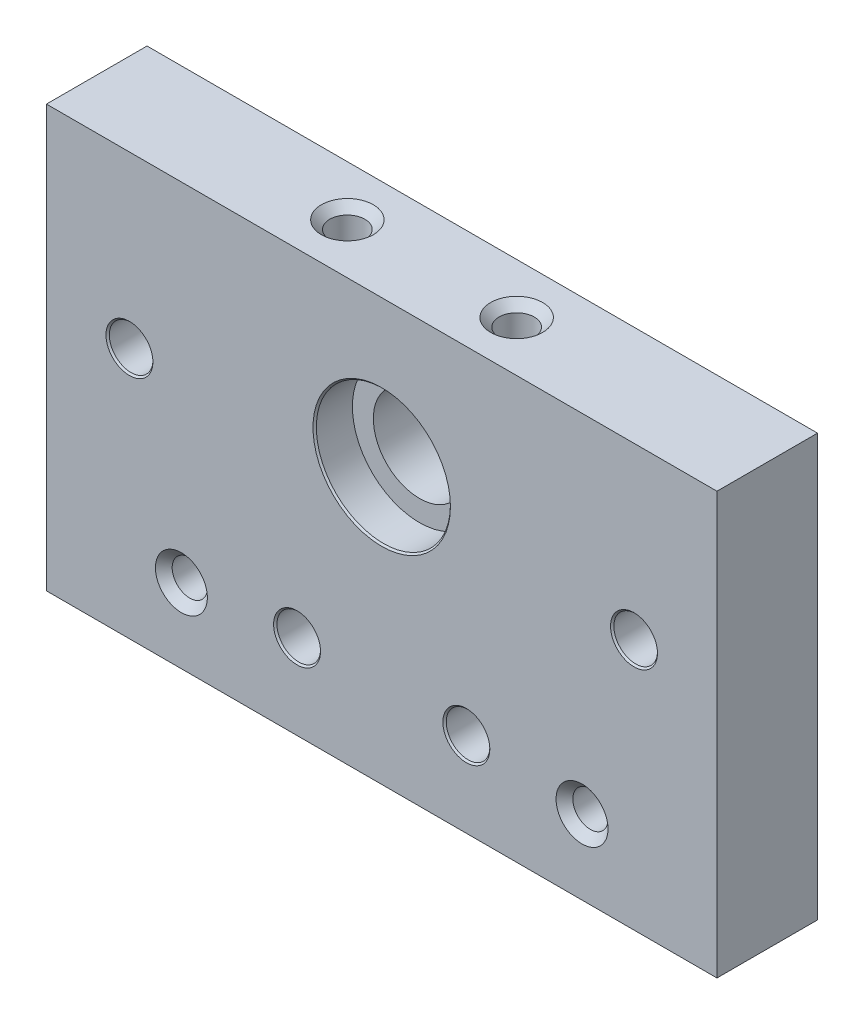
ISO-10303-21;
HEADER;
FILE_DESCRIPTION(('STEP AP214'),'2;1');
FILE_NAME('part.step','',(''),(''),'','','');
FILE_SCHEMA(('AUTOMOTIVE_DESIGN { 1 0 10303 214 1 1 1 1 }'));
ENDSEC;
DATA;
#1=APPLICATION_CONTEXT('core data for automotive mechanical design processes');
#2=APPLICATION_PROTOCOL_DEFINITION('international standard','automotive_design',2000,#1);
#3=PRODUCT_CONTEXT('',#1,'mechanical');
#4=PRODUCT('Part','Part','',(#3));
#5=PRODUCT_RELATED_PRODUCT_CATEGORY('part','',(#4));
#6=PRODUCT_DEFINITION_FORMATION('','',#4);
#7=PRODUCT_DEFINITION_CONTEXT('part definition',#1,'design');
#8=PRODUCT_DEFINITION('design','',#6,#7);
#9=PRODUCT_DEFINITION_SHAPE('','',#8);
#10=(LENGTH_UNIT() NAMED_UNIT(*) SI_UNIT(.MILLI.,.METRE.));
#11=(NAMED_UNIT(*) PLANE_ANGLE_UNIT() SI_UNIT($,.RADIAN.));
#12=(NAMED_UNIT(*) SI_UNIT($,.STERADIAN.) SOLID_ANGLE_UNIT());
#13=UNCERTAINTY_MEASURE_WITH_UNIT(LENGTH_MEASURE(1.E-05),#10,'distance_accuracy_value','');
#14=(GEOMETRIC_REPRESENTATION_CONTEXT(3) GLOBAL_UNCERTAINTY_ASSIGNED_CONTEXT((#13)) GLOBAL_UNIT_ASSIGNED_CONTEXT((#10,
#11,#12)) REPRESENTATION_CONTEXT('',''));
#15=CARTESIAN_POINT('',(0.,0.,0.));
#16=DIRECTION('',(0.,0.,1.));
#17=DIRECTION('',(1.,0.,0.));
#18=AXIS2_PLACEMENT_3D('',#15,#16,#17);
#19=CARTESIAN_POINT('',(28.4884071156695,7.83961797233232,4.62246076924066));
#20=DIRECTION('',(0.,0.,-1.));
#21=DIRECTION('',(-1.,0.,0.));
#22=AXIS2_PLACEMENT_3D('',#19,#20,#21);
#23=CYLINDRICAL_SURFACE('',#22,2.6);
#24=CARTESIAN_POINT('',(28.4884071156695,7.83961797233232,4.42246076924066));
#25=DIRECTION('',(0.,0.,1.));
#26=DIRECTION('',(1.,0.,0.));
#27=AXIS2_PLACEMENT_3D('',#24,#25,#26);
#28=CIRCLE('',#27,2.6);
#29=CARTESIAN_POINT('',(31.0884071156695,7.83961797233232,4.42246076924066));
#30=VERTEX_POINT('',#29);
#31=EDGE_CURVE('E141',#30,#30,#28,.T.);
#32=ORIENTED_EDGE('',*,*,#31,.T.);
#33=EDGE_LOOP('',(#32));
#34=FACE_BOUND('',#33,.T.);
#35=CARTESIAN_POINT('',(28.4884071156695,7.83961797233232,-5.37753923075934));
#36=DIRECTION('',(0.,0.,-1.));
#37=DIRECTION('',(-1.,0.,0.));
#38=AXIS2_PLACEMENT_3D('',#35,#36,#37);
#39=CIRCLE('',#38,2.6);
#40=CARTESIAN_POINT('',(25.8884071156695,7.83961797233232,-5.37753923075934));
#41=VERTEX_POINT('',#40);
#42=EDGE_CURVE('E108',#41,#41,#39,.T.);
#43=ORIENTED_EDGE('',*,*,#42,.T.);
#44=EDGE_LOOP('',(#43));
#45=FACE_BOUND('',#44,.T.);
#46=ADVANCED_FACE('F16',(#34,#45),#23,.F.);
#47=CARTESIAN_POINT('',(8.48840711566945,-12.0603820276677,4.62246076924066));
#48=DIRECTION('',(0.,0.,-1.));
#49=DIRECTION('',(-1.,0.,0.));
#50=AXIS2_PLACEMENT_3D('',#47,#48,#49);
#51=CYLINDRICAL_SURFACE('',#50,2.6);
#52=CARTESIAN_POINT('',(8.48840711566945,-12.0603820276677,4.42246076924066));
#53=DIRECTION('',(0.,0.,1.));
#54=DIRECTION('',(1.,0.,0.));
#55=AXIS2_PLACEMENT_3D('',#52,#53,#54);
#56=CIRCLE('',#55,2.6);
#57=CARTESIAN_POINT('',(11.0884071156695,-12.0603820276677,4.42246076924066));
#58=VERTEX_POINT('',#57);
#59=EDGE_CURVE('E159',#58,#58,#56,.T.);
#60=ORIENTED_EDGE('',*,*,#59,.T.);
#61=EDGE_LOOP('',(#60));
#62=FACE_BOUND('',#61,.T.);
#63=CARTESIAN_POINT('',(8.48840711566945,-12.0603820276677,-5.37753923075934));
#64=DIRECTION('',(0.,0.,-1.));
#65=DIRECTION('',(-1.,0.,0.));
#66=AXIS2_PLACEMENT_3D('',#63,#64,#65);
#67=CIRCLE('',#66,2.6);
#68=CARTESIAN_POINT('',(5.88840711566945,-12.0603820276677,-5.37753923075934));
#69=VERTEX_POINT('',#68);
#70=EDGE_CURVE('E105',#69,#69,#67,.T.);
#71=ORIENTED_EDGE('',*,*,#70,.T.);
#72=EDGE_LOOP('',(#71));
#73=FACE_BOUND('',#72,.T.);
#74=ADVANCED_FACE('F216',(#62,#73),#51,.F.);
#75=CARTESIAN_POINT('',(-31.7115928843306,7.83961797233231,4.62246076924066));
#76=DIRECTION('',(0.,0.,-1.));
#77=DIRECTION('',(-1.,0.,0.));
#78=AXIS2_PLACEMENT_3D('',#75,#76,#77);
#79=CYLINDRICAL_SURFACE('',#78,2.6);
#80=CARTESIAN_POINT('',(-31.7115928843306,7.83961797233231,4.42246076924066));
#81=DIRECTION('',(0.,0.,1.));
#82=DIRECTION('',(1.,0.,0.));
#83=AXIS2_PLACEMENT_3D('',#80,#81,#82);
#84=CIRCLE('',#83,2.6);
#85=CARTESIAN_POINT('',(-29.1115928843306,7.83961797233231,4.42246076924066));
#86=VERTEX_POINT('',#85);
#87=EDGE_CURVE('E168',#86,#86,#84,.T.);
#88=ORIENTED_EDGE('',*,*,#87,.T.);
#89=EDGE_LOOP('',(#88));
#90=FACE_BOUND('',#89,.T.);
#91=CARTESIAN_POINT('',(-31.7115928843306,7.83961797233231,-5.37753923075934));
#92=DIRECTION('',(0.,0.,-1.));
#93=DIRECTION('',(-1.,0.,0.));
#94=AXIS2_PLACEMENT_3D('',#91,#92,#93);
#95=CIRCLE('',#94,2.6);
#96=CARTESIAN_POINT('',(-34.3115928843306,7.83961797233231,-5.37753923075934));
#97=VERTEX_POINT('',#96);
#98=EDGE_CURVE('E101',#97,#97,#95,.T.);
#99=ORIENTED_EDGE('',*,*,#98,.T.);
#100=EDGE_LOOP('',(#99));
#101=FACE_BOUND('',#100,.T.);
#102=ADVANCED_FACE('F222',(#90,#101),#79,.F.);
#103=CARTESIAN_POINT('',(-11.7115928843306,-12.0603820276677,4.62246076924066));
#104=DIRECTION('',(0.,0.,-1.));
#105=DIRECTION('',(-1.,0.,0.));
#106=AXIS2_PLACEMENT_3D('',#103,#104,#105);
#107=CYLINDRICAL_SURFACE('',#106,2.6);
#108=CARTESIAN_POINT('',(-11.7115928843306,-12.0603820276677,4.42246076924066));
#109=DIRECTION('',(0.,0.,1.));
#110=DIRECTION('',(1.,0.,0.));
#111=AXIS2_PLACEMENT_3D('',#108,#109,#110);
#112=CIRCLE('',#111,2.6);
#113=CARTESIAN_POINT('',(-9.11159288433058,-12.0603820276677,4.42246076924066));
#114=VERTEX_POINT('',#113);
#115=EDGE_CURVE('E162',#114,#114,#112,.T.);
#116=ORIENTED_EDGE('',*,*,#115,.T.);
#117=EDGE_LOOP('',(#116));
#118=FACE_BOUND('',#117,.T.);
#119=CARTESIAN_POINT('',(-11.7115928843306,-12.0603820276677,-5.37753923075934));
#120=DIRECTION('',(0.,0.,-1.));
#121=DIRECTION('',(-1.,0.,0.));
#122=AXIS2_PLACEMENT_3D('',#119,#120,#121);
#123=CIRCLE('',#122,2.6);
#124=CARTESIAN_POINT('',(-14.3115928843306,-12.0603820276677,-5.37753923075934));
#125=VERTEX_POINT('',#124);
#126=EDGE_CURVE('E98',#125,#125,#123,.T.);
#127=ORIENTED_EDGE('',*,*,#126,.T.);
#128=EDGE_LOOP('',(#127));
#129=FACE_BOUND('',#128,.T.);
#130=ADVANCED_FACE('F231',(#118,#129),#107,.F.);
#131=CARTESIAN_POINT('',(-1.61159288433057,10.6396179723323,4.62246076924066));
#132=DIRECTION('',(0.,0.,-1.));
#133=DIRECTION('',(-1.,0.,0.));
#134=AXIS2_PLACEMENT_3D('',#131,#132,#133);
#135=CYLINDRICAL_SURFACE('',#134,5.5);
#136=CARTESIAN_POINT('',(-1.61159288433057,10.6396179723323,-7.17753923075933));
#137=DIRECTION('',(0.,0.,1.));
#138=DIRECTION('',(1.,0.,0.));
#139=AXIS2_PLACEMENT_3D('',#136,#137,#138);
#140=CIRCLE('',#139,5.5);
#141=CARTESIAN_POINT('',(3.88840711566943,10.6396179723323,-7.17753923075933));
#142=VERTEX_POINT('',#141);
#143=EDGE_CURVE('E135',#142,#142,#140,.F.);
#144=ORIENTED_EDGE('',*,*,#143,.T.);
#145=EDGE_LOOP('',(#144));
#146=FACE_BOUND('',#145,.T.);
#147=CARTESIAN_POINT('',(-1.61159288433057,10.6396179723323,0.122460769240661));
#148=DIRECTION('',(0.,0.,1.));
#149=DIRECTION('',(1.,0.,0.));
#150=AXIS2_PLACEMENT_3D('',#147,#148,#149);
#151=CIRCLE('',#150,5.5);
#152=CARTESIAN_POINT('',(3.88840711566943,10.6396179723323,0.122460769240661));
#153=VERTEX_POINT('',#152);
#154=EDGE_CURVE('E87',#153,#153,#151,.T.);
#155=ORIENTED_EDGE('',*,*,#154,.T.);
#156=EDGE_LOOP('',(#155));
#157=FACE_BOUND('',#156,.T.);
#158=ADVANCED_FACE('F228',(#146,#157),#135,.F.);
#159=CARTESIAN_POINT('',(-1.61159288433057,2.98961797233234,4.62246076924066));
#160=DIRECTION('',(0.,0.,1.));
#161=DIRECTION('',(1.,0.,0.));
#162=AXIS2_PLACEMENT_3D('',#159,#160,#161);
#163=PLANE('',#162);
#164=CARTESIAN_POINT('',(22.2884071156695,-13.2603820276677,4.62246076924066));
#165=DIRECTION('',(0.,0.,1.));
#166=DIRECTION('',(1.,0.,0.));
#167=AXIS2_PLACEMENT_3D('',#164,#165,#166);
#168=CIRCLE('',#167,3.10000000000001);
#169=CARTESIAN_POINT('',(25.3884071156695,-13.2603820276677,4.62246076924066));
#170=VERTEX_POINT('',#169);
#171=EDGE_CURVE('E198',#170,#170,#168,.F.);
#172=ORIENTED_EDGE('',*,*,#171,.T.);
#173=EDGE_LOOP('',(#172));
#174=FACE_BOUND('',#173,.T.);
#175=CARTESIAN_POINT('',(-25.5115928843306,-13.2603820276677,4.62246076924066));
#176=DIRECTION('',(0.,0.,1.));
#177=DIRECTION('',(1.,0.,0.));
#178=AXIS2_PLACEMENT_3D('',#175,#176,#177);
#179=CIRCLE('',#178,3.09999999999999);
#180=CARTESIAN_POINT('',(-22.4115928843306,-13.2603820276677,4.62246076924066));
#181=VERTEX_POINT('',#180);
#182=EDGE_CURVE('E195',#181,#181,#179,.F.);
#183=ORIENTED_EDGE('',*,*,#182,.T.);
#184=EDGE_LOOP('',(#183));
#185=FACE_BOUND('',#184,.T.);
#186=CARTESIAN_POINT('',(28.4884071156695,7.83961797233232,4.62246076924066));
#187=DIRECTION('',(0.,0.,1.));
#188=DIRECTION('',(1.,0.,0.));
#189=AXIS2_PLACEMENT_3D('',#186,#187,#188);
#190=CIRCLE('',#189,2.8);
#191=CARTESIAN_POINT('',(31.2884071156695,7.83961797233232,4.62246076924066));
#192=VERTEX_POINT('',#191);
#193=EDGE_CURVE('E156',#192,#192,#190,.F.);
#194=ORIENTED_EDGE('',*,*,#193,.T.);
#195=EDGE_LOOP('',(#194));
#196=FACE_BOUND('',#195,.T.);
#197=CARTESIAN_POINT('',(8.48840711566945,-12.0603820276677,4.62246076924066));
#198=DIRECTION('',(0.,0.,1.));
#199=DIRECTION('',(1.,0.,0.));
#200=AXIS2_PLACEMENT_3D('',#197,#198,#199);
#201=CIRCLE('',#200,2.8);
#202=CARTESIAN_POINT('',(11.2884071156695,-12.0603820276677,4.62246076924066));
#203=VERTEX_POINT('',#202);
#204=EDGE_CURVE('E153',#203,#203,#201,.F.);
#205=ORIENTED_EDGE('',*,*,#204,.T.);
#206=EDGE_LOOP('',(#205));
#207=FACE_BOUND('',#206,.T.);
#208=CARTESIAN_POINT('',(-11.7115928843306,-12.0603820276677,4.62246076924066));
#209=DIRECTION('',(0.,0.,1.));
#210=DIRECTION('',(1.,0.,0.));
#211=AXIS2_PLACEMENT_3D('',#208,#209,#210);
#212=CIRCLE('',#211,2.8);
#213=CARTESIAN_POINT('',(-8.91159288433058,-12.0603820276677,4.62246076924066));
#214=VERTEX_POINT('',#213);
#215=EDGE_CURVE('E150',#214,#214,#212,.F.);
#216=ORIENTED_EDGE('',*,*,#215,.T.);
#217=EDGE_LOOP('',(#216));
#218=FACE_BOUND('',#217,.T.);
#219=CARTESIAN_POINT('',(-1.61159288433057,10.6396179723323,4.62246076924066));
#220=DIRECTION('',(0.,0.,1.));
#221=DIRECTION('',(1.,0.,0.));
#222=AXIS2_PLACEMENT_3D('',#219,#220,#221);
#223=CIRCLE('',#222,8.2);
#224=CARTESIAN_POINT('',(6.58840711566943,10.6396179723323,4.62246076924066));
#225=VERTEX_POINT('',#224);
#226=EDGE_CURVE('E147',#225,#225,#223,.F.);
#227=ORIENTED_EDGE('',*,*,#226,.T.);
#228=EDGE_LOOP('',(#227));
#229=FACE_BOUND('',#228,.T.);
#230=CARTESIAN_POINT('',(-31.7115928843306,7.83961797233231,4.62246076924066));
#231=DIRECTION('',(0.,0.,1.));
#232=DIRECTION('',(1.,0.,0.));
#233=AXIS2_PLACEMENT_3D('',#230,#231,#232);
#234=CIRCLE('',#233,2.8);
#235=CARTESIAN_POINT('',(-28.9115928843306,7.83961797233231,4.62246076924066));
#236=VERTEX_POINT('',#235);
#237=EDGE_CURVE('E144',#236,#236,#234,.F.);
#238=ORIENTED_EDGE('',*,*,#237,.T.);
#239=EDGE_LOOP('',(#238));
#240=FACE_BOUND('',#239,.T.);
#241=DIRECTION('',(0.,-1.,0.));
#242=VECTOR('',#241,1.);
#243=CARTESIAN_POINT('',(-41.6115928843305,-22.1603820276677,4.62246076924066));
#244=LINE('',#243,#242);
#245=CARTESIAN_POINT('',(-41.6115928843305,28.1396179723323,4.62246076924066));
#246=VERTEX_POINT('',#245);
#247=CARTESIAN_POINT('',(-41.6115928843305,-22.1603820276677,4.62246076924066));
#248=VERTEX_POINT('',#247);
#249=EDGE_CURVE('E69',#246,#248,#244,.T.);
#250=ORIENTED_EDGE('',*,*,#249,.T.);
#251=DIRECTION('',(1.,0.,0.));
#252=VECTOR('',#251,1.);
#253=CARTESIAN_POINT('',(38.3884071156695,-22.1603820276677,4.62246076924066));
#254=LINE('',#253,#252);
#255=CARTESIAN_POINT('',(38.3884071156695,-22.1603820276677,4.62246076924066));
#256=VERTEX_POINT('',#255);
#257=EDGE_CURVE('E64',#248,#256,#254,.T.);
#258=ORIENTED_EDGE('',*,*,#257,.T.);
#259=DIRECTION('',(0.,1.,0.));
#260=VECTOR('',#259,1.);
#261=CARTESIAN_POINT('',(38.3884071156695,-22.1603820276677,4.62246076924066));
#262=LINE('',#261,#260);
#263=CARTESIAN_POINT('',(38.3884071156695,28.1396179723323,4.62246076924066));
#264=VERTEX_POINT('',#263);
#265=EDGE_CURVE('E67',#256,#264,#262,.T.);
#266=ORIENTED_EDGE('',*,*,#265,.T.);
#267=DIRECTION('',(-1.,0.,0.));
#268=VECTOR('',#267,1.);
#269=CARTESIAN_POINT('',(38.3884071156695,28.1396179723323,4.62246076924066));
#270=LINE('',#269,#268);
#271=EDGE_CURVE('E33',#264,#246,#270,.T.);
#272=ORIENTED_EDGE('',*,*,#271,.T.);
#273=EDGE_LOOP('',(#250,#258,#266,#272));
#274=FACE_BOUND('',#273,.T.);
#275=ADVANCED_FACE('F65',(#174,#185,#196,#207,#218,#229,#240,#274),#163,.T.);
#276=CARTESIAN_POINT('',(-1.61159288433057,2.98961797233234,-7.37753923075934));
#277=DIRECTION('',(0.,0.,1.));
#278=DIRECTION('',(1.,0.,0.));
#279=AXIS2_PLACEMENT_3D('',#276,#277,#278);
#280=PLANE('',#279);
#281=CARTESIAN_POINT('',(22.2884071156695,-13.2603820276677,-7.37753923075934));
#282=DIRECTION('',(0.,0.,1.));
#283=DIRECTION('',(1.,0.,0.));
#284=AXIS2_PLACEMENT_3D('',#281,#282,#283);
#285=CIRCLE('',#284,3.10000000000002);
#286=CARTESIAN_POINT('',(25.3884071156695,-13.2603820276677,-7.37753923075934));
#287=VERTEX_POINT('',#286);
#288=EDGE_CURVE('E186',#287,#287,#285,.T.);
#289=ORIENTED_EDGE('',*,*,#288,.T.);
#290=EDGE_LOOP('',(#289));
#291=FACE_BOUND('',#290,.T.);
#292=CARTESIAN_POINT('',(-25.5115928843306,-13.2603820276677,-7.37753923075934));
#293=DIRECTION('',(0.,0.,1.));
#294=DIRECTION('',(1.,0.,0.));
#295=AXIS2_PLACEMENT_3D('',#292,#293,#294);
#296=CIRCLE('',#295,3.10000000000002);
#297=CARTESIAN_POINT('',(-22.4115928843306,-13.2603820276677,-7.37753923075934));
#298=VERTEX_POINT('',#297);
#299=EDGE_CURVE('E183',#298,#298,#296,.T.);
#300=ORIENTED_EDGE('',*,*,#299,.T.);
#301=EDGE_LOOP('',(#300));
#302=FACE_BOUND('',#301,.T.);
#303=CARTESIAN_POINT('',(-31.7115928843306,7.83961797233231,-7.37753923075934));
#304=DIRECTION('',(0.,0.,1.));
#305=DIRECTION('',(1.,0.,0.));
#306=AXIS2_PLACEMENT_3D('',#303,#304,#305);
#307=CIRCLE('',#306,4.7);
#308=CARTESIAN_POINT('',(-27.0115928843306,7.83961797233231,-7.37753923075934));
#309=VERTEX_POINT('',#308);
#310=EDGE_CURVE('E126',#309,#309,#307,.T.);
#311=ORIENTED_EDGE('',*,*,#310,.T.);
#312=EDGE_LOOP('',(#311));
#313=FACE_BOUND('',#312,.T.);
#314=CARTESIAN_POINT('',(-11.7115928843306,-12.0603820276677,-7.37753923075934));
#315=DIRECTION('',(0.,0.,1.));
#316=DIRECTION('',(1.,0.,0.));
#317=AXIS2_PLACEMENT_3D('',#314,#315,#316);
#318=CIRCLE('',#317,4.7);
#319=CARTESIAN_POINT('',(-7.01159288433059,-12.0603820276677,-7.37753923075934));
#320=VERTEX_POINT('',#319);
#321=EDGE_CURVE('E123',#320,#320,#318,.T.);
#322=ORIENTED_EDGE('',*,*,#321,.T.);
#323=EDGE_LOOP('',(#322));
#324=FACE_BOUND('',#323,.T.);
#325=CARTESIAN_POINT('',(8.48840711566945,-12.0603820276677,-7.37753923075934));
#326=DIRECTION('',(0.,0.,1.));
#327=DIRECTION('',(1.,0.,0.));
#328=AXIS2_PLACEMENT_3D('',#325,#326,#327);
#329=CIRCLE('',#328,4.7);
#330=CARTESIAN_POINT('',(13.1884071156694,-12.0603820276677,-7.37753923075934));
#331=VERTEX_POINT('',#330);
#332=EDGE_CURVE('E120',#331,#331,#329,.T.);
#333=ORIENTED_EDGE('',*,*,#332,.T.);
#334=EDGE_LOOP('',(#333));
#335=FACE_BOUND('',#334,.T.);
#336=CARTESIAN_POINT('',(-1.61159288433057,10.6396179723323,-7.37753923075934));
#337=DIRECTION('',(0.,0.,1.));
#338=DIRECTION('',(1.,0.,0.));
#339=AXIS2_PLACEMENT_3D('',#336,#337,#338);
#340=CIRCLE('',#339,5.7);
#341=CARTESIAN_POINT('',(4.08840711566944,10.6396179723323,-7.37753923075934));
#342=VERTEX_POINT('',#341);
#343=EDGE_CURVE('E117',#342,#342,#340,.T.);
#344=ORIENTED_EDGE('',*,*,#343,.T.);
#345=EDGE_LOOP('',(#344));
#346=FACE_BOUND('',#345,.T.);
#347=CARTESIAN_POINT('',(28.4884071156695,7.83961797233232,-7.37753923075934));
#348=DIRECTION('',(0.,0.,1.));
#349=DIRECTION('',(1.,0.,0.));
#350=AXIS2_PLACEMENT_3D('',#347,#348,#349);
#351=CIRCLE('',#350,4.7);
#352=CARTESIAN_POINT('',(33.1884071156694,7.83961797233232,-7.37753923075934));
#353=VERTEX_POINT('',#352);
#354=EDGE_CURVE('E114',#353,#353,#351,.T.);
#355=ORIENTED_EDGE('',*,*,#354,.T.);
#356=EDGE_LOOP('',(#355));
#357=FACE_BOUND('',#356,.T.);
#358=DIRECTION('',(0.,-1.,0.));
#359=VECTOR('',#358,1.);
#360=CARTESIAN_POINT('',(-41.6115928843305,-22.1603820276677,-7.37753923075934));
#361=LINE('',#360,#359);
#362=CARTESIAN_POINT('',(-41.6115928843305,28.1396179723323,-7.37753923075934));
#363=VERTEX_POINT('',#362);
#364=CARTESIAN_POINT('',(-41.6115928843305,-22.1603820276677,-7.37753923075934));
#365=VERTEX_POINT('',#364);
#366=EDGE_CURVE('E84',#363,#365,#361,.T.);
#367=ORIENTED_EDGE('',*,*,#366,.F.);
#368=DIRECTION('',(-1.,0.,0.));
#369=VECTOR('',#368,1.);
#370=CARTESIAN_POINT('',(38.3884071156695,28.1396179723323,-7.37753923075934));
#371=LINE('',#370,#369);
#372=CARTESIAN_POINT('',(38.3884071156695,28.1396179723323,-7.37753923075934));
#373=VERTEX_POINT('',#372);
#374=EDGE_CURVE('E56',#373,#363,#371,.T.);
#375=ORIENTED_EDGE('',*,*,#374,.F.);
#376=DIRECTION('',(0.,1.,0.));
#377=VECTOR('',#376,1.);
#378=CARTESIAN_POINT('',(38.3884071156695,-22.1603820276677,-7.37753923075934));
#379=LINE('',#378,#377);
#380=CARTESIAN_POINT('',(38.3884071156695,-22.1603820276677,-7.37753923075934));
#381=VERTEX_POINT('',#380);
#382=EDGE_CURVE('E50',#381,#373,#379,.T.);
#383=ORIENTED_EDGE('',*,*,#382,.F.);
#384=DIRECTION('',(1.,0.,0.));
#385=VECTOR('',#384,1.);
#386=CARTESIAN_POINT('',(38.3884071156695,-22.1603820276677,-7.37753923075934));
#387=LINE('',#386,#385);
#388=EDGE_CURVE('E74',#365,#381,#387,.T.);
#389=ORIENTED_EDGE('',*,*,#388,.F.);
#390=EDGE_LOOP('',(#367,#375,#383,#389));
#391=FACE_BOUND('',#390,.T.);
#392=ADVANCED_FACE('F235',(#291,#302,#313,#324,#335,#346,#357,#391),#280,.F.);
#393=CARTESIAN_POINT('',(-41.6115928843305,-22.1603820276677,4.62246076924066));
#394=DIRECTION('',(1.,0.,0.));
#395=DIRECTION('',(0.,0.,-1.));
#396=AXIS2_PLACEMENT_3D('',#393,#394,#395);
#397=PLANE('',#396);
#398=ORIENTED_EDGE('',*,*,#366,.T.);
#399=DIRECTION('',(0.,0.,-1.));
#400=VECTOR('',#399,1.);
#401=CARTESIAN_POINT('',(-41.6115928843305,-22.1603820276677,4.62246076924066));
#402=LINE('',#401,#400);
#403=EDGE_CURVE('E75',#248,#365,#402,.T.);
#404=ORIENTED_EDGE('',*,*,#403,.F.);
#405=ORIENTED_EDGE('',*,*,#249,.F.);
#406=DIRECTION('',(0.,0.,-1.));
#407=VECTOR('',#406,1.);
#408=CARTESIAN_POINT('',(-41.6115928843305,28.1396179723323,4.62246076924066));
#409=LINE('',#408,#407);
#410=EDGE_CURVE('E80',#246,#363,#409,.T.);
#411=ORIENTED_EDGE('',*,*,#410,.T.);
#412=EDGE_LOOP('',(#398,#404,#405,#411));
#413=FACE_BOUND('',#412,.T.);
#414=ADVANCED_FACE('F239',(#413),#397,.F.);
#415=CARTESIAN_POINT('',(38.3884071156695,-22.1603820276677,4.62246076924066));
#416=DIRECTION('',(0.,1.,0.));
#417=DIRECTION('',(-1.,0.,0.));
#418=AXIS2_PLACEMENT_3D('',#415,#416,#417);
#419=PLANE('',#418);
#420=ORIENTED_EDGE('',*,*,#388,.T.);
#421=DIRECTION('',(0.,0.,-1.));
#422=VECTOR('',#421,1.);
#423=CARTESIAN_POINT('',(38.3884071156695,-22.1603820276677,4.62246076924066));
#424=LINE('',#423,#422);
#425=EDGE_CURVE('E72',#256,#381,#424,.T.);
#426=ORIENTED_EDGE('',*,*,#425,.F.);
#427=ORIENTED_EDGE('',*,*,#257,.F.);
#428=ORIENTED_EDGE('',*,*,#403,.T.);
#429=EDGE_LOOP('',(#420,#426,#427,#428));
#430=FACE_BOUND('',#429,.T.);
#431=ADVANCED_FACE('F73',(#430),#419,.F.);
#432=CARTESIAN_POINT('',(38.3884071156695,-22.1603820276677,4.62246076924066));
#433=DIRECTION('',(-1.,0.,0.));
#434=DIRECTION('',(0.,0.,1.));
#435=AXIS2_PLACEMENT_3D('',#432,#433,#434);
#436=PLANE('',#435);
#437=ORIENTED_EDGE('',*,*,#382,.T.);
#438=DIRECTION('',(0.,0.,-1.));
#439=VECTOR('',#438,1.);
#440=CARTESIAN_POINT('',(38.3884071156695,28.1396179723323,4.62246076924066));
#441=LINE('',#440,#439);
#442=EDGE_CURVE('E76',#264,#373,#441,.T.);
#443=ORIENTED_EDGE('',*,*,#442,.F.);
#444=ORIENTED_EDGE('',*,*,#265,.F.);
#445=ORIENTED_EDGE('',*,*,#425,.T.);
#446=EDGE_LOOP('',(#437,#443,#444,#445));
#447=FACE_BOUND('',#446,.T.);
#448=ADVANCED_FACE('F78',(#447),#436,.F.);
#449=CARTESIAN_POINT('',(38.3884071156695,28.1396179723323,4.62246076924066));
#450=DIRECTION('',(0.,-1.,0.));
#451=DIRECTION('',(1.,0.,0.));
#452=AXIS2_PLACEMENT_3D('',#449,#450,#451);
#453=PLANE('',#452);
#454=CARTESIAN_POINT('',(8.48840711566941,28.1396179723323,-1.37753923075934));
#455=DIRECTION('',(0.,-1.,0.));
#456=DIRECTION('',(1.,0.,0.));
#457=AXIS2_PLACEMENT_3D('',#454,#455,#456);
#458=CIRCLE('',#457,3.10000000000001);
#459=CARTESIAN_POINT('',(11.5884071156694,28.1396179723323,-1.37753923075934));
#460=VERTEX_POINT('',#459);
#461=EDGE_CURVE('E177',#460,#460,#458,.T.);
#462=ORIENTED_EDGE('',*,*,#461,.T.);
#463=EDGE_LOOP('',(#462));
#464=FACE_BOUND('',#463,.T.);
#465=CARTESIAN_POINT('',(-11.7115928843305,28.1396179723323,-1.37753923075934));
#466=DIRECTION('',(0.,-1.,0.));
#467=DIRECTION('',(1.,0.,0.));
#468=AXIS2_PLACEMENT_3D('',#465,#466,#467);
#469=CIRCLE('',#468,3.1);
#470=CARTESIAN_POINT('',(-8.61159288433055,28.1396179723323,-1.37753923075934));
#471=VERTEX_POINT('',#470);
#472=EDGE_CURVE('E174',#471,#471,#469,.T.);
#473=ORIENTED_EDGE('',*,*,#472,.T.);
#474=EDGE_LOOP('',(#473));
#475=FACE_BOUND('',#474,.T.);
#476=ORIENTED_EDGE('',*,*,#374,.T.);
#477=ORIENTED_EDGE('',*,*,#410,.F.);
#478=ORIENTED_EDGE('',*,*,#271,.F.);
#479=ORIENTED_EDGE('',*,*,#442,.T.);
#480=EDGE_LOOP('',(#476,#477,#478,#479));
#481=FACE_BOUND('',#480,.T.);
#482=ADVANCED_FACE('F241',(#464,#475,#481),#453,.F.);
#483=CARTESIAN_POINT('',(22.2884071156695,-13.2603820276677,4.62246076924066));
#484=DIRECTION('',(0.,0.,-1.));
#485=DIRECTION('',(-1.,0.,0.));
#486=AXIS2_PLACEMENT_3D('',#483,#484,#485);
#487=CYLINDRICAL_SURFACE('',#486,2.1);
#488=CARTESIAN_POINT('',(22.2884071156695,-13.2603820276677,-6.37753923075931));
#489=DIRECTION('',(0.,0.,1.));
#490=DIRECTION('',(1.,0.,0.));
#491=AXIS2_PLACEMENT_3D('',#488,#489,#490);
#492=CIRCLE('',#491,2.1);
#493=CARTESIAN_POINT('',(24.3884071156695,-13.2603820276677,-6.37753923075931));
#494=VERTEX_POINT('',#493);
#495=EDGE_CURVE('E192',#494,#494,#492,.F.);
#496=ORIENTED_EDGE('',*,*,#495,.T.);
#497=EDGE_LOOP('',(#496));
#498=FACE_BOUND('',#497,.T.);
#499=CARTESIAN_POINT('',(22.2884071156695,-13.2603820276677,3.62246076924065));
#500=DIRECTION('',(0.,0.,1.));
#501=DIRECTION('',(1.,0.,0.));
#502=AXIS2_PLACEMENT_3D('',#499,#500,#501);
#503=CIRCLE('',#502,2.1);
#504=CARTESIAN_POINT('',(24.3884071156695,-13.2603820276677,3.62246076924065));
#505=VERTEX_POINT('',#504);
#506=EDGE_CURVE('E189',#505,#505,#503,.T.);
#507=ORIENTED_EDGE('',*,*,#506,.T.);
#508=EDGE_LOOP('',(#507));
#509=FACE_BOUND('',#508,.T.);
#510=ADVANCED_FACE('F244',(#498,#509),#487,.F.);
#511=CARTESIAN_POINT('',(-25.5115928843306,-13.2603820276677,4.62246076924066));
#512=DIRECTION('',(0.,0.,-1.));
#513=DIRECTION('',(-1.,0.,0.));
#514=AXIS2_PLACEMENT_3D('',#511,#512,#513);
#515=CYLINDRICAL_SURFACE('',#514,2.1);
#516=CARTESIAN_POINT('',(-25.5115928843306,-13.2603820276677,-6.37753923075931));
#517=DIRECTION('',(0.,0.,1.));
#518=DIRECTION('',(1.,0.,0.));
#519=AXIS2_PLACEMENT_3D('',#516,#517,#518);
#520=CIRCLE('',#519,2.1);
#521=CARTESIAN_POINT('',(-23.4115928843306,-13.2603820276677,-6.37753923075931));
#522=VERTEX_POINT('',#521);
#523=EDGE_CURVE('E10',#522,#522,#520,.F.);
#524=ORIENTED_EDGE('',*,*,#523,.T.);
#525=EDGE_LOOP('',(#524));
#526=FACE_BOUND('',#525,.T.);
#527=CARTESIAN_POINT('',(-25.5115928843306,-13.2603820276677,3.62246076924068));
#528=DIRECTION('',(0.,0.,1.));
#529=DIRECTION('',(1.,0.,0.));
#530=AXIS2_PLACEMENT_3D('',#527,#528,#529);
#531=CIRCLE('',#530,2.1);
#532=CARTESIAN_POINT('',(-23.4115928843306,-13.2603820276677,3.62246076924068));
#533=VERTEX_POINT('',#532);
#534=EDGE_CURVE('E25',#533,#533,#531,.T.);
#535=ORIENTED_EDGE('',*,*,#534,.T.);
#536=EDGE_LOOP('',(#535));
#537=FACE_BOUND('',#536,.T.);
#538=ADVANCED_FACE('F203',(#526,#537),#515,.F.);
#539=CARTESIAN_POINT('',(-1.61159288433057,10.6396179723323,0.122460769240661));
#540=DIRECTION('',(0.,0.,1.));
#541=DIRECTION('',(1.,0.,0.));
#542=AXIS2_PLACEMENT_3D('',#539,#540,#541);
#543=CYLINDRICAL_SURFACE('',#542,8.);
#544=CARTESIAN_POINT('',(-1.61159288433057,10.6396179723323,4.42246076924066));
#545=DIRECTION('',(0.,0.,1.));
#546=DIRECTION('',(1.,0.,0.));
#547=AXIS2_PLACEMENT_3D('',#544,#545,#546);
#548=CIRCLE('',#547,8.);
#549=CARTESIAN_POINT('',(6.38840711566943,10.6396179723323,4.42246076924066));
#550=VERTEX_POINT('',#549);
#551=EDGE_CURVE('E165',#550,#550,#548,.T.);
#552=ORIENTED_EDGE('',*,*,#551,.T.);
#553=EDGE_LOOP('',(#552));
#554=FACE_BOUND('',#553,.T.);
#555=CARTESIAN_POINT('',(-1.61159288433057,10.6396179723323,0.122460769240661));
#556=DIRECTION('',(0.,0.,1.));
#557=DIRECTION('',(1.,0.,0.));
#558=AXIS2_PLACEMENT_3D('',#555,#556,#557);
#559=CIRCLE('',#558,8.);
#560=CARTESIAN_POINT('',(6.38840711566943,10.6396179723323,0.122460769240661));
#561=VERTEX_POINT('',#560);
#562=EDGE_CURVE('E97',#561,#561,#559,.T.);
#563=ORIENTED_EDGE('',*,*,#562,.F.);
#564=EDGE_LOOP('',(#563));
#565=FACE_BOUND('',#564,.T.);
#566=ADVANCED_FACE('F319',(#554,#565),#543,.F.);
#567=CARTESIAN_POINT('',(-1.61159288433057,10.6396179723323,0.122460769240661));
#568=DIRECTION('',(0.,0.,1.));
#569=DIRECTION('',(1.,0.,0.));
#570=AXIS2_PLACEMENT_3D('',#567,#568,#569);
#571=PLANE('',#570);
#572=ORIENTED_EDGE('',*,*,#154,.F.);
#573=EDGE_LOOP('',(#572));
#574=FACE_BOUND('',#573,.T.);
#575=ORIENTED_EDGE('',*,*,#562,.T.);
#576=EDGE_LOOP('',(#575));
#577=FACE_BOUND('',#576,.T.);
#578=ADVANCED_FACE('F331',(#574,#577),#571,.T.);
#579=CARTESIAN_POINT('',(8.48840711566941,17.1396179723323,-1.37753923075934));
#580=DIRECTION('',(0.,1.,0.));
#581=DIRECTION('',(-1.,0.,0.));
#582=AXIS2_PLACEMENT_3D('',#579,#580,#581);
#583=CYLINDRICAL_SURFACE('',#582,2.1);
#584=CARTESIAN_POINT('',(8.48840711566941,27.1396179723323,-1.37753923075934));
#585=DIRECTION('',(0.,-1.,0.));
#586=DIRECTION('',(1.,0.,0.));
#587=AXIS2_PLACEMENT_3D('',#584,#585,#586);
#588=CIRCLE('',#587,2.1);
#589=CARTESIAN_POINT('',(10.5884071156694,27.1396179723323,-1.37753923075934));
#590=VERTEX_POINT('',#589);
#591=EDGE_CURVE('E171',#590,#590,#588,.F.);
#592=ORIENTED_EDGE('',*,*,#591,.T.);
#593=EDGE_LOOP('',(#592));
#594=FACE_BOUND('',#593,.T.);
#595=CARTESIAN_POINT('',(8.48840711566941,17.1396179723323,-1.37753923075934));
#596=DIRECTION('',(0.,1.,0.));
#597=DIRECTION('',(1.,0.,0.));
#598=AXIS2_PLACEMENT_3D('',#595,#596,#597);
#599=CIRCLE('',#598,2.1);
#600=CARTESIAN_POINT('',(10.5884071156694,17.1396179723323,-1.37753923075934));
#601=VERTEX_POINT('',#600);
#602=EDGE_CURVE('E111',#601,#601,#599,.T.);
#603=ORIENTED_EDGE('',*,*,#602,.F.);
#604=EDGE_LOOP('',(#603));
#605=FACE_BOUND('',#604,.T.);
#606=ADVANCED_FACE('F335',(#594,#605),#583,.F.);
#607=CARTESIAN_POINT('',(8.48840711566941,17.1396179723323,-1.37753923075934));
#608=DIRECTION('',(0.,-1.,0.));
#609=DIRECTION('',(1.,0.,0.));
#610=AXIS2_PLACEMENT_3D('',#607,#608,#609);
#611=PLANE('',#610);
#612=ORIENTED_EDGE('',*,*,#602,.T.);
#613=EDGE_LOOP('',(#612));
#614=FACE_BOUND('',#613,.T.);
#615=ADVANCED_FACE('F339',(#614),#611,.F.);
#616=CARTESIAN_POINT('',(-11.7115928843305,17.1396179723323,-1.37753923075934));
#617=DIRECTION('',(0.,1.,0.));
#618=DIRECTION('',(-1.,0.,0.));
#619=AXIS2_PLACEMENT_3D('',#616,#617,#618);
#620=CYLINDRICAL_SURFACE('',#619,2.1);
#621=CARTESIAN_POINT('',(-11.7115928843305,27.1396179723323,-1.37753923075934));
#622=DIRECTION('',(0.,-1.,0.));
#623=DIRECTION('',(1.,0.,0.));
#624=AXIS2_PLACEMENT_3D('',#621,#622,#623);
#625=CIRCLE('',#624,2.1);
#626=CARTESIAN_POINT('',(-9.61159288433054,27.1396179723323,-1.37753923075934));
#627=VERTEX_POINT('',#626);
#628=EDGE_CURVE('E180',#627,#627,#625,.F.);
#629=ORIENTED_EDGE('',*,*,#628,.T.);
#630=EDGE_LOOP('',(#629));
#631=FACE_BOUND('',#630,.T.);
#632=CARTESIAN_POINT('',(-11.7115928843305,17.1396179723323,-1.37753923075934));
#633=DIRECTION('',(0.,1.,0.));
#634=DIRECTION('',(-1.,0.,0.));
#635=AXIS2_PLACEMENT_3D('',#632,#633,#634);
#636=CIRCLE('',#635,2.1);
#637=CARTESIAN_POINT('',(-13.8115928843305,17.1396179723323,-1.37753923075934));
#638=VERTEX_POINT('',#637);
#639=EDGE_CURVE('E400',#638,#638,#636,.T.);
#640=ORIENTED_EDGE('',*,*,#639,.F.);
#641=EDGE_LOOP('',(#640));
#642=FACE_BOUND('',#641,.T.);
#643=ADVANCED_FACE('F343',(#631,#642),#620,.F.);
#644=CARTESIAN_POINT('',(-11.7115928843305,17.1396179723323,-1.37753923075934));
#645=DIRECTION('',(0.,1.,0.));
#646=DIRECTION('',(-1.,0.,0.));
#647=AXIS2_PLACEMENT_3D('',#644,#645,#646);
#648=PLANE('',#647);
#649=ORIENTED_EDGE('',*,*,#639,.T.);
#650=EDGE_LOOP('',(#649));
#651=FACE_BOUND('',#650,.T.);
#652=ADVANCED_FACE('F347',(#651),#648,.T.);
#653=CARTESIAN_POINT('',(-11.7115928843306,-12.0603820276677,-5.37753923075934));
#654=DIRECTION('',(0.,0.,-1.));
#655=DIRECTION('',(-1.,0.,0.));
#656=AXIS2_PLACEMENT_3D('',#653,#654,#655);
#657=CYLINDRICAL_SURFACE('',#656,4.5);
#658=CARTESIAN_POINT('',(-11.7115928843306,-12.0603820276677,-7.17753923075933));
#659=DIRECTION('',(0.,0.,1.));
#660=DIRECTION('',(1.,0.,0.));
#661=AXIS2_PLACEMENT_3D('',#658,#659,#660);
#662=CIRCLE('',#661,4.5);
#663=CARTESIAN_POINT('',(-7.21159288433058,-12.0603820276677,-7.17753923075933));
#664=VERTEX_POINT('',#663);
#665=EDGE_CURVE('E129',#664,#664,#662,.F.);
#666=ORIENTED_EDGE('',*,*,#665,.T.);
#667=EDGE_LOOP('',(#666));
#668=FACE_BOUND('',#667,.T.);
#669=CARTESIAN_POINT('',(-11.7115928843306,-12.0603820276677,-5.37753923075934));
#670=DIRECTION('',(0.,0.,-1.));
#671=DIRECTION('',(-1.,0.,0.));
#672=AXIS2_PLACEMENT_3D('',#669,#670,#671);
#673=CIRCLE('',#672,4.5);
#674=CARTESIAN_POINT('',(-16.2115928843306,-12.0603820276677,-5.37753923075934));
#675=VERTEX_POINT('',#674);
#676=EDGE_CURVE('E395',#675,#675,#673,.T.);
#677=ORIENTED_EDGE('',*,*,#676,.F.);
#678=EDGE_LOOP('',(#677));
#679=FACE_BOUND('',#678,.T.);
#680=ADVANCED_FACE('F351',(#668,#679),#657,.F.);
#681=CARTESIAN_POINT('',(-11.7115928843306,-12.0603820276677,-5.37753923075934));
#682=DIRECTION('',(0.,0.,-1.));
#683=DIRECTION('',(-1.,0.,0.));
#684=AXIS2_PLACEMENT_3D('',#681,#682,#683);
#685=PLANE('',#684);
#686=ORIENTED_EDGE('',*,*,#126,.F.);
#687=EDGE_LOOP('',(#686));
#688=FACE_BOUND('',#687,.T.);
#689=ORIENTED_EDGE('',*,*,#676,.T.);
#690=EDGE_LOOP('',(#689));
#691=FACE_BOUND('',#690,.T.);
#692=ADVANCED_FACE('F357',(#688,#691),#685,.T.);
#693=CARTESIAN_POINT('',(-31.7115928843306,7.83961797233231,-5.37753923075934));
#694=DIRECTION('',(0.,0.,-1.));
#695=DIRECTION('',(-1.,0.,0.));
#696=AXIS2_PLACEMENT_3D('',#693,#694,#695);
#697=CYLINDRICAL_SURFACE('',#696,4.5);
#698=CARTESIAN_POINT('',(-31.7115928843306,7.83961797233231,-7.17753923075933));
#699=DIRECTION('',(0.,0.,1.));
#700=DIRECTION('',(1.,0.,0.));
#701=AXIS2_PLACEMENT_3D('',#698,#699,#700);
#702=CIRCLE('',#701,4.5);
#703=CARTESIAN_POINT('',(-27.2115928843306,7.83961797233231,-7.17753923075933));
#704=VERTEX_POINT('',#703);
#705=EDGE_CURVE('E94',#704,#704,#702,.F.);
#706=ORIENTED_EDGE('',*,*,#705,.T.);
#707=EDGE_LOOP('',(#706));
#708=FACE_BOUND('',#707,.T.);
#709=CARTESIAN_POINT('',(-31.7115928843306,7.83961797233231,-5.37753923075934));
#710=DIRECTION('',(0.,0.,-1.));
#711=DIRECTION('',(-1.,0.,0.));
#712=AXIS2_PLACEMENT_3D('',#709,#710,#711);
#713=CIRCLE('',#712,4.5);
#714=CARTESIAN_POINT('',(-36.2115928843306,7.83961797233231,-5.37753923075934));
#715=VERTEX_POINT('',#714);
#716=EDGE_CURVE('E392',#715,#715,#713,.T.);
#717=ORIENTED_EDGE('',*,*,#716,.F.);
#718=EDGE_LOOP('',(#717));
#719=FACE_BOUND('',#718,.T.);
#720=ADVANCED_FACE('F353',(#708,#719),#697,.F.);
#721=CARTESIAN_POINT('',(-31.7115928843306,7.83961797233231,-5.37753923075934));
#722=DIRECTION('',(0.,0.,-1.));
#723=DIRECTION('',(-1.,0.,0.));
#724=AXIS2_PLACEMENT_3D('',#721,#722,#723);
#725=PLANE('',#724);
#726=ORIENTED_EDGE('',*,*,#98,.F.);
#727=EDGE_LOOP('',(#726));
#728=FACE_BOUND('',#727,.T.);
#729=ORIENTED_EDGE('',*,*,#716,.T.);
#730=EDGE_LOOP('',(#729));
#731=FACE_BOUND('',#730,.T.);
#732=ADVANCED_FACE('F356',(#728,#731),#725,.T.);
#733=CARTESIAN_POINT('',(8.48840711566945,-12.0603820276677,-5.37753923075934));
#734=DIRECTION('',(0.,0.,-1.));
#735=DIRECTION('',(-1.,0.,0.));
#736=AXIS2_PLACEMENT_3D('',#733,#734,#735);
#737=CYLINDRICAL_SURFACE('',#736,4.5);
#738=CARTESIAN_POINT('',(8.48840711566945,-12.0603820276677,-7.17753923075933));
#739=DIRECTION('',(0.,0.,1.));
#740=DIRECTION('',(1.,0.,0.));
#741=AXIS2_PLACEMENT_3D('',#738,#739,#740);
#742=CIRCLE('',#741,4.5);
#743=CARTESIAN_POINT('',(12.9884071156695,-12.0603820276677,-7.17753923075933));
#744=VERTEX_POINT('',#743);
#745=EDGE_CURVE('E132',#744,#744,#742,.F.);
#746=ORIENTED_EDGE('',*,*,#745,.T.);
#747=EDGE_LOOP('',(#746));
#748=FACE_BOUND('',#747,.T.);
#749=CARTESIAN_POINT('',(8.48840711566945,-12.0603820276677,-5.37753923075934));
#750=DIRECTION('',(0.,0.,-1.));
#751=DIRECTION('',(-1.,0.,0.));
#752=AXIS2_PLACEMENT_3D('',#749,#750,#751);
#753=CIRCLE('',#752,4.5);
#754=CARTESIAN_POINT('',(3.98840711566945,-12.0603820276677,-5.37753923075934));
#755=VERTEX_POINT('',#754);
#756=EDGE_CURVE('E389',#755,#755,#753,.T.);
#757=ORIENTED_EDGE('',*,*,#756,.F.);
#758=EDGE_LOOP('',(#757));
#759=FACE_BOUND('',#758,.T.);
#760=ADVANCED_FACE('F361',(#748,#759),#737,.F.);
#761=CARTESIAN_POINT('',(8.48840711566945,-12.0603820276677,-5.37753923075934));
#762=DIRECTION('',(0.,0.,-1.));
#763=DIRECTION('',(-1.,0.,0.));
#764=AXIS2_PLACEMENT_3D('',#761,#762,#763);
#765=PLANE('',#764);
#766=ORIENTED_EDGE('',*,*,#70,.F.);
#767=EDGE_LOOP('',(#766));
#768=FACE_BOUND('',#767,.T.);
#769=ORIENTED_EDGE('',*,*,#756,.T.);
#770=EDGE_LOOP('',(#769));
#771=FACE_BOUND('',#770,.T.);
#772=ADVANCED_FACE('F365',(#768,#771),#765,.T.);
#773=CARTESIAN_POINT('',(28.4884071156695,7.83961797233232,-5.37753923075934));
#774=DIRECTION('',(0.,0.,-1.));
#775=DIRECTION('',(-1.,0.,0.));
#776=AXIS2_PLACEMENT_3D('',#773,#774,#775);
#777=CYLINDRICAL_SURFACE('',#776,4.5);
#778=CARTESIAN_POINT('',(28.4884071156695,7.83961797233232,-7.17753923075933));
#779=DIRECTION('',(0.,0.,1.));
#780=DIRECTION('',(1.,0.,0.));
#781=AXIS2_PLACEMENT_3D('',#778,#779,#780);
#782=CIRCLE('',#781,4.5);
#783=CARTESIAN_POINT('',(32.9884071156695,7.83961797233232,-7.17753923075933));
#784=VERTEX_POINT('',#783);
#785=EDGE_CURVE('E138',#784,#784,#782,.F.);
#786=ORIENTED_EDGE('',*,*,#785,.T.);
#787=EDGE_LOOP('',(#786));
#788=FACE_BOUND('',#787,.T.);
#789=CARTESIAN_POINT('',(28.4884071156695,7.83961797233232,-5.37753923075934));
#790=DIRECTION('',(0.,0.,-1.));
#791=DIRECTION('',(-1.,0.,0.));
#792=AXIS2_PLACEMENT_3D('',#789,#790,#791);
#793=CIRCLE('',#792,4.5);
#794=CARTESIAN_POINT('',(23.9884071156695,7.83961797233232,-5.37753923075934));
#795=VERTEX_POINT('',#794);
#796=EDGE_CURVE('E102',#795,#795,#793,.T.);
#797=ORIENTED_EDGE('',*,*,#796,.F.);
#798=EDGE_LOOP('',(#797));
#799=FACE_BOUND('',#798,.T.);
#800=ADVANCED_FACE('F369',(#788,#799),#777,.F.);
#801=CARTESIAN_POINT('',(28.4884071156695,7.83961797233232,-5.37753923075934));
#802=DIRECTION('',(0.,0.,-1.));
#803=DIRECTION('',(-1.,0.,0.));
#804=AXIS2_PLACEMENT_3D('',#801,#802,#803);
#805=PLANE('',#804);
#806=ORIENTED_EDGE('',*,*,#42,.F.);
#807=EDGE_LOOP('',(#806));
#808=FACE_BOUND('',#807,.T.);
#809=ORIENTED_EDGE('',*,*,#796,.T.);
#810=EDGE_LOOP('',(#809));
#811=FACE_BOUND('',#810,.T.);
#812=ADVANCED_FACE('F257',(#808,#811),#805,.T.);
#813=CARTESIAN_POINT('',(-31.7115928843306,7.83961797233231,-7.17753923075933));
#814=DIRECTION('',(0.,0.,-1.));
#815=DIRECTION('',(-1.,0.,0.));
#816=AXIS2_PLACEMENT_3D('',#813,#814,#815);
#817=CONICAL_SURFACE('',#816,4.5,0.785398163397409);
#818=ORIENTED_EDGE('',*,*,#310,.F.);
#819=EDGE_LOOP('',(#818));
#820=FACE_BOUND('',#819,.T.);
#821=ORIENTED_EDGE('',*,*,#705,.F.);
#822=EDGE_LOOP('',(#821));
#823=FACE_BOUND('',#822,.T.);
#824=ADVANCED_FACE('F253',(#820,#823),#817,.F.);
#825=CARTESIAN_POINT('',(-11.7115928843306,-12.0603820276677,-7.17753923075933));
#826=DIRECTION('',(0.,0.,-1.));
#827=DIRECTION('',(-1.,0.,0.));
#828=AXIS2_PLACEMENT_3D('',#825,#826,#827);
#829=CONICAL_SURFACE('',#828,4.5,0.785398163397409);
#830=ORIENTED_EDGE('',*,*,#321,.F.);
#831=EDGE_LOOP('',(#830));
#832=FACE_BOUND('',#831,.T.);
#833=ORIENTED_EDGE('',*,*,#665,.F.);
#834=EDGE_LOOP('',(#833));
#835=FACE_BOUND('',#834,.T.);
#836=ADVANCED_FACE('F256',(#832,#835),#829,.F.);
#837=CARTESIAN_POINT('',(8.48840711566945,-12.0603820276677,-7.17753923075933));
#838=DIRECTION('',(0.,0.,-1.));
#839=DIRECTION('',(-1.,0.,0.));
#840=AXIS2_PLACEMENT_3D('',#837,#838,#839);
#841=CONICAL_SURFACE('',#840,4.5,0.785398163397409);
#842=ORIENTED_EDGE('',*,*,#332,.F.);
#843=EDGE_LOOP('',(#842));
#844=FACE_BOUND('',#843,.T.);
#845=ORIENTED_EDGE('',*,*,#745,.F.);
#846=EDGE_LOOP('',(#845));
#847=FACE_BOUND('',#846,.T.);
#848=ADVANCED_FACE('F261',(#844,#847),#841,.F.);
#849=CARTESIAN_POINT('',(-1.61159288433057,10.6396179723323,-7.37753923075934));
#850=DIRECTION('',(0.,0.,-1.));
#851=DIRECTION('',(-1.,0.,0.));
#852=AXIS2_PLACEMENT_3D('',#849,#850,#851);
#853=CONICAL_SURFACE('',#852,5.7,0.785398163397435);
#854=ORIENTED_EDGE('',*,*,#143,.F.);
#855=EDGE_LOOP('',(#854));
#856=FACE_BOUND('',#855,.T.);
#857=ORIENTED_EDGE('',*,*,#343,.F.);
#858=EDGE_LOOP('',(#857));
#859=FACE_BOUND('',#858,.T.);
#860=ADVANCED_FACE('F265',(#856,#859),#853,.F.);
#861=CARTESIAN_POINT('',(28.4884071156695,7.83961797233232,-7.17753923075933));
#862=DIRECTION('',(0.,0.,-1.));
#863=DIRECTION('',(-1.,0.,0.));
#864=AXIS2_PLACEMENT_3D('',#861,#862,#863);
#865=CONICAL_SURFACE('',#864,4.5,0.785398163397409);
#866=ORIENTED_EDGE('',*,*,#354,.F.);
#867=EDGE_LOOP('',(#866));
#868=FACE_BOUND('',#867,.T.);
#869=ORIENTED_EDGE('',*,*,#785,.F.);
#870=EDGE_LOOP('',(#869));
#871=FACE_BOUND('',#870,.T.);
#872=ADVANCED_FACE('F269',(#868,#871),#865,.F.);
#873=CARTESIAN_POINT('',(28.4884071156695,7.83961797233232,4.42246076924066));
#874=DIRECTION('',(0.,0.,1.));
#875=DIRECTION('',(1.,0.,0.));
#876=AXIS2_PLACEMENT_3D('',#873,#874,#875);
#877=CONICAL_SURFACE('',#876,2.6,0.785398163397435);
#878=ORIENTED_EDGE('',*,*,#193,.F.);
#879=EDGE_LOOP('',(#878));
#880=FACE_BOUND('',#879,.T.);
#881=ORIENTED_EDGE('',*,*,#31,.F.);
#882=EDGE_LOOP('',(#881));
#883=FACE_BOUND('',#882,.T.);
#884=ADVANCED_FACE('F273',(#880,#883),#877,.F.);
#885=CARTESIAN_POINT('',(8.48840711566945,-12.0603820276677,4.42246076924066));
#886=DIRECTION('',(0.,0.,1.));
#887=DIRECTION('',(1.,0.,0.));
#888=AXIS2_PLACEMENT_3D('',#885,#886,#887);
#889=CONICAL_SURFACE('',#888,2.6,0.785398163397436);
#890=ORIENTED_EDGE('',*,*,#204,.F.);
#891=EDGE_LOOP('',(#890));
#892=FACE_BOUND('',#891,.T.);
#893=ORIENTED_EDGE('',*,*,#59,.F.);
#894=EDGE_LOOP('',(#893));
#895=FACE_BOUND('',#894,.T.);
#896=ADVANCED_FACE('F277',(#892,#895),#889,.F.);
#897=CARTESIAN_POINT('',(-11.7115928843306,-12.0603820276677,4.42246076924066));
#898=DIRECTION('',(0.,0.,1.));
#899=DIRECTION('',(1.,0.,0.));
#900=AXIS2_PLACEMENT_3D('',#897,#898,#899);
#901=CONICAL_SURFACE('',#900,2.6,0.785398163397436);
#902=ORIENTED_EDGE('',*,*,#215,.F.);
#903=EDGE_LOOP('',(#902));
#904=FACE_BOUND('',#903,.T.);
#905=ORIENTED_EDGE('',*,*,#115,.F.);
#906=EDGE_LOOP('',(#905));
#907=FACE_BOUND('',#906,.T.);
#908=ADVANCED_FACE('F281',(#904,#907),#901,.F.);
#909=CARTESIAN_POINT('',(-1.61159288433057,10.6396179723323,4.42246076924066));
#910=DIRECTION('',(0.,0.,1.));
#911=DIRECTION('',(1.,0.,0.));
#912=AXIS2_PLACEMENT_3D('',#909,#910,#911);
#913=CONICAL_SURFACE('',#912,8.,0.785398163397448);
#914=ORIENTED_EDGE('',*,*,#226,.F.);
#915=EDGE_LOOP('',(#914));
#916=FACE_BOUND('',#915,.T.);
#917=ORIENTED_EDGE('',*,*,#551,.F.);
#918=EDGE_LOOP('',(#917));
#919=FACE_BOUND('',#918,.T.);
#920=ADVANCED_FACE('F285',(#916,#919),#913,.F.);
#921=CARTESIAN_POINT('',(-31.7115928843306,7.83961797233231,4.42246076924066));
#922=DIRECTION('',(0.,0.,1.));
#923=DIRECTION('',(1.,0.,0.));
#924=AXIS2_PLACEMENT_3D('',#921,#922,#923);
#925=CONICAL_SURFACE('',#924,2.6,0.785398163397436);
#926=ORIENTED_EDGE('',*,*,#237,.F.);
#927=EDGE_LOOP('',(#926));
#928=FACE_BOUND('',#927,.T.);
#929=ORIENTED_EDGE('',*,*,#87,.F.);
#930=EDGE_LOOP('',(#929));
#931=FACE_BOUND('',#930,.T.);
#932=ADVANCED_FACE('F289',(#928,#931),#925,.F.);
#933=CARTESIAN_POINT('',(8.48840711566941,27.1396179723323,-1.37753923075934));
#934=DIRECTION('',(0.,1.,0.));
#935=DIRECTION('',(-1.,0.,0.));
#936=AXIS2_PLACEMENT_3D('',#933,#934,#935);
#937=CONICAL_SURFACE('',#936,2.1,0.785398163397453);
#938=ORIENTED_EDGE('',*,*,#461,.F.);
#939=EDGE_LOOP('',(#938));
#940=FACE_BOUND('',#939,.T.);
#941=ORIENTED_EDGE('',*,*,#591,.F.);
#942=EDGE_LOOP('',(#941));
#943=FACE_BOUND('',#942,.T.);
#944=ADVANCED_FACE('F293',(#940,#943),#937,.F.);
#945=CARTESIAN_POINT('',(-11.7115928843305,27.1396179723323,-1.37753923075934));
#946=DIRECTION('',(0.,1.,0.));
#947=DIRECTION('',(-1.,0.,0.));
#948=AXIS2_PLACEMENT_3D('',#945,#946,#947);
#949=CONICAL_SURFACE('',#948,2.1,0.785398163397443);
#950=ORIENTED_EDGE('',*,*,#472,.F.);
#951=EDGE_LOOP('',(#950));
#952=FACE_BOUND('',#951,.T.);
#953=ORIENTED_EDGE('',*,*,#628,.F.);
#954=EDGE_LOOP('',(#953));
#955=FACE_BOUND('',#954,.T.);
#956=ADVANCED_FACE('F297',(#952,#955),#949,.F.);
#957=CARTESIAN_POINT('',(22.2884071156695,-13.2603820276677,-7.37753923075934));
#958=DIRECTION('',(0.,0.,-1.));
#959=DIRECTION('',(-1.,0.,0.));
#960=AXIS2_PLACEMENT_3D('',#957,#958,#959);
#961=CONICAL_SURFACE('',#960,3.10000000000002,0.785398163397445);
#962=ORIENTED_EDGE('',*,*,#495,.F.);
#963=EDGE_LOOP('',(#962));
#964=FACE_BOUND('',#963,.T.);
#965=ORIENTED_EDGE('',*,*,#288,.F.);
#966=EDGE_LOOP('',(#965));
#967=FACE_BOUND('',#966,.T.);
#968=ADVANCED_FACE('F301',(#964,#967),#961,.F.);
#969=CARTESIAN_POINT('',(22.2884071156695,-13.2603820276677,3.62246076924065));
#970=DIRECTION('',(0.,0.,1.));
#971=DIRECTION('',(1.,0.,0.));
#972=AXIS2_PLACEMENT_3D('',#969,#970,#971);
#973=CONICAL_SURFACE('',#972,2.1,0.785398163397445);
#974=ORIENTED_EDGE('',*,*,#171,.F.);
#975=EDGE_LOOP('',(#974));
#976=FACE_BOUND('',#975,.T.);
#977=ORIENTED_EDGE('',*,*,#506,.F.);
#978=EDGE_LOOP('',(#977));
#979=FACE_BOUND('',#978,.T.);
#980=ADVANCED_FACE('F212',(#976,#979),#973,.F.);
#981=CARTESIAN_POINT('',(-25.5115928843306,-13.2603820276677,-7.37753923075934));
#982=DIRECTION('',(0.,0.,-1.));
#983=DIRECTION('',(-1.,0.,0.));
#984=AXIS2_PLACEMENT_3D('',#981,#982,#983);
#985=CONICAL_SURFACE('',#984,3.10000000000002,0.785398163397445);
#986=ORIENTED_EDGE('',*,*,#523,.F.);
#987=EDGE_LOOP('',(#986));
#988=FACE_BOUND('',#987,.T.);
#989=ORIENTED_EDGE('',*,*,#299,.F.);
#990=EDGE_LOOP('',(#989));
#991=FACE_BOUND('',#990,.T.);
#992=ADVANCED_FACE('F206',(#988,#991),#985,.F.);
#993=CARTESIAN_POINT('',(-25.5115928843306,-13.2603820276677,3.62246076924068));
#994=DIRECTION('',(0.,0.,1.));
#995=DIRECTION('',(1.,0.,0.));
#996=AXIS2_PLACEMENT_3D('',#993,#994,#995);
#997=CONICAL_SURFACE('',#996,2.1,0.785398163397452);
#998=ORIENTED_EDGE('',*,*,#182,.F.);
#999=EDGE_LOOP('',(#998));
#1000=FACE_BOUND('',#999,.T.);
#1001=ORIENTED_EDGE('',*,*,#534,.F.);
#1002=EDGE_LOOP('',(#1001));
#1003=FACE_BOUND('',#1002,.T.);
#1004=ADVANCED_FACE('F18',(#1000,#1003),#997,.F.);
#1005=CLOSED_SHELL('',(#46,#74,#102,#130,#158,#275,#392,#414,#431,#448,#482,#510,#538,#566,#578,
#606,#615,#643,#652,#680,#692,#720,#732,#760,#772,#800,#812,#824,#836,#848,#860,#872,#884,#896,
#908,#920,#932,#944,#956,#968,#980,#992,#1004));
#1006=MANIFOLD_SOLID_BREP('B1',#1005);
#1007=ADVANCED_BREP_SHAPE_REPRESENTATION('',(#18,#1006),#14);
#1008=SHAPE_DEFINITION_REPRESENTATION(#9,#1007);
ENDSEC;
END-ISO-10303-21;
